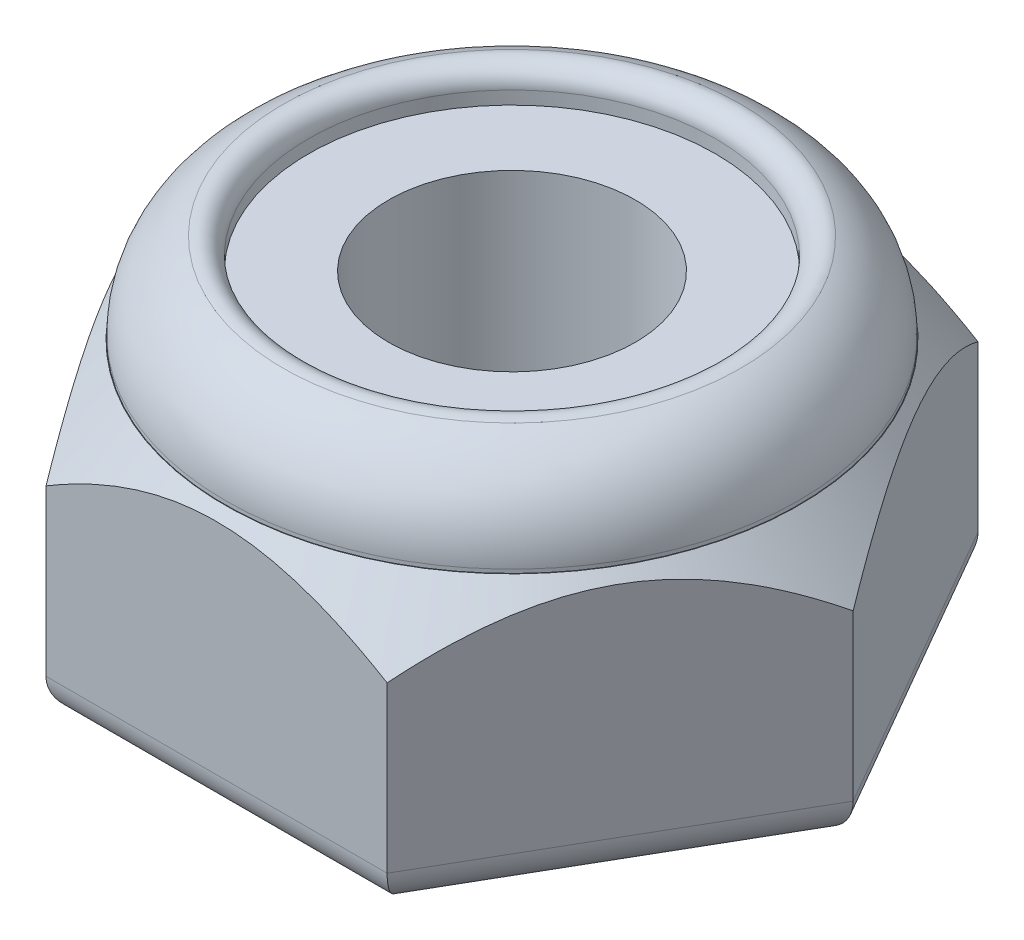
ISO-10303-21;
HEADER;
FILE_DESCRIPTION(('STEP AP214'),'2;1');
FILE_NAME('part.step','',(''),(''),'','','');
FILE_SCHEMA(('AUTOMOTIVE_DESIGN { 1 0 10303 214 1 1 1 1 }'));
ENDSEC;
DATA;
#1=APPLICATION_CONTEXT('core data for automotive mechanical design processes');
#2=APPLICATION_PROTOCOL_DEFINITION('international standard','automotive_design',2000,#1);
#3=PRODUCT_CONTEXT('',#1,'mechanical');
#4=PRODUCT('Part','Part','',(#3));
#5=PRODUCT_RELATED_PRODUCT_CATEGORY('part','',(#4));
#6=PRODUCT_DEFINITION_FORMATION('','',#4);
#7=PRODUCT_DEFINITION_CONTEXT('part definition',#1,'design');
#8=PRODUCT_DEFINITION('design','',#6,#7);
#9=PRODUCT_DEFINITION_SHAPE('','',#8);
#10=(LENGTH_UNIT() NAMED_UNIT(*) SI_UNIT(.MILLI.,.METRE.));
#11=(NAMED_UNIT(*) PLANE_ANGLE_UNIT() SI_UNIT($,.RADIAN.));
#12=(NAMED_UNIT(*) SI_UNIT($,.STERADIAN.) SOLID_ANGLE_UNIT());
#13=UNCERTAINTY_MEASURE_WITH_UNIT(LENGTH_MEASURE(1.E-05),#10,'distance_accuracy_value','');
#14=(GEOMETRIC_REPRESENTATION_CONTEXT(3) GLOBAL_UNCERTAINTY_ASSIGNED_CONTEXT((#13)) GLOBAL_UNIT_ASSIGNED_CONTEXT((#10,
#11,#12)) REPRESENTATION_CONTEXT('',''));
#15=CARTESIAN_POINT('',(0.,0.,0.));
#16=DIRECTION('',(0.,0.,1.));
#17=DIRECTION('',(1.,0.,0.));
#18=AXIS2_PLACEMENT_3D('',#15,#16,#17);
#19=CARTESIAN_POINT('',(0.,4.9784,0.));
#20=DIRECTION('',(0.,-1.,0.));
#21=DIRECTION('',(0.,0.,-1.));
#22=AXIS2_PLACEMENT_3D('',#19,#20,#21);
#23=CYLINDRICAL_SURFACE('',#22,3.937);
#24=CARTESIAN_POINT('',(0.,3.7084,0.));
#25=DIRECTION('',(0.,1.,0.));
#26=DIRECTION('',(0.,0.,1.));
#27=AXIS2_PLACEMENT_3D('',#24,#25,#26);
#28=CIRCLE('',#27,3.937);
#29=CARTESIAN_POINT('',(0.,3.7084,3.937));
#30=VERTEX_POINT('',#29);
#31=EDGE_CURVE('E243',#30,#30,#28,.T.);
#32=ORIENTED_EDGE('',*,*,#31,.F.);
#33=EDGE_LOOP('',(#32));
#34=FACE_BOUND('',#33,.T.);
#35=CARTESIAN_POINT('',(0.,3.6576,0.));
#36=DIRECTION('',(0.,-1.,0.));
#37=DIRECTION('',(0.,0.,-1.));
#38=AXIS2_PLACEMENT_3D('',#35,#36,#37);
#39=CIRCLE('',#38,3.937);
#40=CARTESIAN_POINT('',(0.,3.6576,-3.937));
#41=VERTEX_POINT('',#40);
#42=EDGE_CURVE('E19',#41,#41,#39,.F.);
#43=ORIENTED_EDGE('',*,*,#42,.T.);
#44=EDGE_LOOP('',(#43));
#45=FACE_BOUND('',#44,.T.);
#46=ADVANCED_FACE('F16',(#34,#45),#23,.T.);
#47=CARTESIAN_POINT('',(0.,3.7084,0.));
#48=DIRECTION('',(0.,1.,0.));
#49=DIRECTION('',(0.,0.,1.));
#50=AXIS2_PLACEMENT_3D('',#47,#48,#49);
#51=TOROIDAL_SURFACE('',#50,2.667,1.27);
#52=ORIENTED_EDGE('',*,*,#31,.T.);
#53=EDGE_LOOP('',(#52));
#54=FACE_BOUND('',#53,.T.);
#55=CARTESIAN_POINT('',(0.,4.88572150982644,0.));
#56=DIRECTION('',(0.,-1.,0.));
#57=DIRECTION('',(0.,0.,-1.));
#58=AXIS2_PLACEMENT_3D('',#55,#56,#57);
#59=CIRCLE('',#58,3.14325);
#60=CARTESIAN_POINT('',(0.,4.88572150982644,-3.14325));
#61=VERTEX_POINT('',#60);
#62=EDGE_CURVE('E237',#61,#61,#59,.F.);
#63=ORIENTED_EDGE('',*,*,#62,.F.);
#64=EDGE_LOOP('',(#63));
#65=FACE_BOUND('',#64,.T.);
#66=ADVANCED_FACE('F134',(#54,#65),#51,.T.);
#67=CARTESIAN_POINT('',(2.34315,3.6576,4.05845484975502));
#68=DIRECTION('',(0.,-1.,0.));
#69=DIRECTION('',(0.,0.,-1.));
#70=AXIS2_PLACEMENT_3D('',#67,#68,#69);
#71=PLANE('',#70);
#72=ORIENTED_EDGE('',*,*,#42,.F.);
#73=EDGE_LOOP('',(#72));
#74=FACE_BOUND('',#73,.T.);
#75=CARTESIAN_POINT('',(0.,3.65760000011051,0.));
#76=DIRECTION('',(0.,-1.,0.));
#77=DIRECTION('',(0.,0.,-1.));
#78=AXIS2_PLACEMENT_3D('',#75,#76,#77);
#79=CIRCLE('',#78,3.94407100938664);
#80=CARTESIAN_POINT('',(0.,3.65760000011051,-3.94407100938664));
#81=VERTEX_POINT('',#80);
#82=EDGE_CURVE('E119',#81,#81,#79,.T.);
#83=ORIENTED_EDGE('',*,*,#82,.F.);
#84=EDGE_LOOP('',(#83));
#85=FACE_BOUND('',#84,.T.);
#86=ADVANCED_FACE('F129',(#74,#85),#71,.F.);
#87=CARTESIAN_POINT('',(0.,4.65025720786115,0.));
#88=DIRECTION('',(0.,-1.,0.));
#89=DIRECTION('',(0.,0.,-1.));
#90=AXIS2_PLACEMENT_3D('',#87,#88,#89);
#91=TOROIDAL_SURFACE('',#90,3.048,0.254);
#92=CARTESIAN_POINT('',(0.,4.65025720786115,0.));
#93=DIRECTION('',(0.,1.,0.));
#94=DIRECTION('',(0.,0.,1.));
#95=AXIS2_PLACEMENT_3D('',#92,#93,#94);
#96=CIRCLE('',#95,2.794);
#97=CARTESIAN_POINT('',(0.,4.65025720786115,2.794));
#98=VERTEX_POINT('',#97);
#99=EDGE_CURVE('E104',#98,#98,#96,.F.);
#100=ORIENTED_EDGE('',*,*,#99,.T.);
#101=EDGE_LOOP('',(#100));
#102=FACE_BOUND('',#101,.T.);
#103=ORIENTED_EDGE('',*,*,#62,.T.);
#104=EDGE_LOOP('',(#103));
#105=FACE_BOUND('',#104,.T.);
#106=ADVANCED_FACE('F125',(#102,#105),#91,.T.);
#107=CARTESIAN_POINT('',(0.,2.76773860969115,0.));
#108=DIRECTION('',(0.,-1.,0.));
#109=DIRECTION('',(0.,0.,-1.));
#110=AXIS2_PLACEMENT_3D('',#107,#108,#109);
#111=CONICAL_SURFACE('',#110,4.69075337389313,0.698131700802158);
#112=CARTESIAN_POINT('',(-4.68630000001476,2.77304593398821,-5.33338044389321E-11));
#113=CARTESIAN_POINT('',(-4.65177717141793,2.81418235889091,0.0597952931149053));
#114=CARTESIAN_POINT('',(-4.61695780288956,2.85432113110728,0.120104208500933));
#115=CARTESIAN_POINT('',(-4.54666264441453,2.93230661020916,0.241858994511412));
#116=CARTESIAN_POINT('',(-4.51118655194523,2.97015222462005,0.303305389120424));
#117=CARTESIAN_POINT('',(-4.40329561885259,3.08018701500149,0.490177966909937));
#118=CARTESIAN_POINT('',(-4.32983334004397,3.14837015576205,0.617418366247689));
#119=CARTESIAN_POINT('',(-4.1797796499728,3.27092778609509,0.877318981315214));
#120=CARTESIAN_POINT('',(-4.10317943932402,3.32525984886677,1.00999443802899));
#121=CARTESIAN_POINT('',(-3.94747591651277,3.41577217646148,1.27968085045525));
#122=CARTESIAN_POINT('',(-3.86837998243724,3.45200143013375,1.4166790269463));
#123=CARTESIAN_POINT('',(-3.73746585196202,3.49372811243502,1.64342895235813));
#124=CARTESIAN_POINT('',(-3.68614686019516,3.50560413715319,1.73231605349153));
#125=CARTESIAN_POINT('',(-3.58316406708587,3.52008140702852,1.91068748346216));
#126=CARTESIAN_POINT('',(-3.53150020834088,3.5226810675312,2.00017191172355));
#127=CARTESIAN_POINT('',(-3.42855034551142,3.51847006524789,2.17848630477643));
#128=CARTESIAN_POINT('',(-3.3772638088531,3.51171021118306,2.26731719201287));
#129=CARTESIAN_POINT('',(-3.27519197708947,3.48921023555424,2.4441107906491));
#130=CARTESIAN_POINT('',(-3.22440670715057,3.4734696654174,2.53207345845939));
#131=CARTESIAN_POINT('',(-3.10963060134479,3.42817062222156,2.73087150520989));
#132=CARTESIAN_POINT('',(-3.04589899577138,3.39598542076133,2.84125788411099));
#133=CARTESIAN_POINT('',(-2.92018166739655,3.32004827846255,3.05900668424801));
#134=CARTESIAN_POINT('',(-2.85819691962206,3.27629001415058,3.16636741668776));
#135=CARTESIAN_POINT('',(-2.735889068299,3.17910361386979,3.37821082934389));
#136=CARTESIAN_POINT('',(-2.67557364738244,3.12563730731956,3.48268020285126));
#137=CARTESIAN_POINT('',(-2.55683004320588,3.01104764609313,3.68835015835892));
#138=CARTESIAN_POINT('',(-2.49840123089761,2.94992687749399,3.78955182990274));
#139=CARTESIAN_POINT('',(-2.42439626092569,2.86741854625153,3.91773219790672));
#140=CARTESIAN_POINT('',(-2.40802320106583,2.84883596648691,3.94609116945937));
#141=CARTESIAN_POINT('',(-2.3754621576302,2.81125673907332,4.00248855103733));
#142=CARTESIAN_POINT('',(-2.35927376441604,2.79226151161516,4.03052767057717));
#143=CARTESIAN_POINT('',(-2.3431499999717,2.77304593399368,4.05845484980404));
#144=B_SPLINE_CURVE_WITH_KNOTS('',3,(#112,#113,#114,#115,#116,#117,#118,#119,#120,#121,#122,
#123,#124,#125,#126,#127,#128,#129,#130,#131,#132,#133,#134,#135,#136,#137,#138,#139,#140,#141,
#142,#143),.UNSPECIFIED.,.F.,.F.,(4,2,2,2,2,2,2,2,2,2,2,2,2,2,2,4),(0.,0.241096809088565,
0.48230758945251,0.967637153847366,1.45443592242802,1.93991010956963,2.24950193433618,
2.55914664324831,2.86711700071403,3.17510274216898,3.56882084711336,3.96275452403261,
4.35827201930639,4.75365624679115,4.86660838982692,4.97921936905084),.UNSPECIFIED.);
#145=CARTESIAN_POINT('',(-4.68630000002839,2.77304593399358,0.));
#146=VERTEX_POINT('',#145);
#147=CARTESIAN_POINT('',(-2.34315000001419,2.77304593399358,4.05845484977959));
#148=VERTEX_POINT('',#147);
#149=EDGE_CURVE('E91',#146,#148,#144,.T.);
#150=ORIENTED_EDGE('',*,*,#149,.T.);
#151=CARTESIAN_POINT('',(-2.34315000005357,2.77304593398822,4.05845484974113));
#152=CARTESIAN_POINT('',(-2.27415972170409,2.81414935271336,4.05845484974989));
#153=CARTESIAN_POINT('',(-2.20457738522044,2.85425669884705,4.05845484975361));
#154=CARTESIAN_POINT('',(-2.06410193528095,2.93218331968194,4.05845484975642));
#155=CARTESIAN_POINT('',(-1.99320821641151,2.9700015013142,4.05845484975551));
#156=CARTESIAN_POINT('',(-1.77754688772429,3.07999086386455,4.05845484975401));
#157=CARTESIAN_POINT('',(-1.63068545869954,3.1481589403704,4.05845484975469));
#158=CARTESIAN_POINT('',(-1.33052752457963,3.27077676919262,4.05845484975534));
#159=CARTESIAN_POINT('',(-1.17720631609342,3.32516696804196,4.0584548497553));
#160=CARTESIAN_POINT('',(-0.86561350380778,3.41574608766059,4.05845484975473));
#161=CARTESIAN_POINT('',(-0.707359229311903,3.45199244874899,4.0584548497542));
#162=CARTESIAN_POINT('',(-0.456822143345071,3.49192146546895,4.05845484975548));
#163=CARTESIAN_POINT('',(-0.365672921156202,3.50290887295604,4.05845484975637));
#164=CARTESIAN_POINT('',(-0.183016322004482,3.51758027913678,4.05845484975366));
#165=CARTESIAN_POINT('',(-0.0915105175250816,3.52128341037061,4.05845484975007));
#166=CARTESIAN_POINT('',(0.104649468641441,3.52128177491765,4.0584548497495));
#167=CARTESIAN_POINT('',(0.209305100872023,3.51643705333648,4.05845484975354));
#168=CARTESIAN_POINT('',(0.41778718190987,3.49730239560235,4.05845484975649));
#169=CARTESIAN_POINT('',(0.521613181352877,3.48300765111694,4.05845484975541));
#170=CARTESIAN_POINT('',(0.728332544913561,3.44553375886282,4.05845484975462));
#171=CARTESIAN_POINT('',(0.831215331558566,3.42229697724238,4.05845484975491));
#172=CARTESIAN_POINT('',(1.03487580391125,3.36791830054733,4.05845484975512));
#173=CARTESIAN_POINT('',(1.13565289468809,3.33677420321768,4.05845484975504));
#174=CARTESIAN_POINT('',(1.33273383822163,3.26838741918099,4.05845484975499));
#175=CARTESIAN_POINT('',(1.42908716226035,3.23128582684656,4.05845484975501));
#176=CARTESIAN_POINT('',(1.61947291708309,3.15151071591982,4.05845484975502));
#177=CARTESIAN_POINT('',(1.71350470709807,3.10883567899407,4.05845484975502));
#178=CARTESIAN_POINT('',(1.89803195382395,3.01941532331662,4.05845484975501));
#179=CARTESIAN_POINT('',(1.98855798046432,2.97273255726059,4.05845484975502));
#180=CARTESIAN_POINT('',(2.16742834958163,2.87556944084479,4.05845484975502));
#181=CARTESIAN_POINT('',(2.25577492892455,2.82509321932285,4.05845484975502));
#182=CARTESIAN_POINT('',(2.34315000005566,2.77304593399424,4.05845484975502));
#183=B_SPLINE_CURVE_WITH_KNOTS('',3,(#151,#152,#153,#154,#155,#156,#157,#158,#159,#160,#161,
#162,#163,#164,#165,#166,#167,#168,#169,#170,#171,#172,#173,#174,#175,#176,#177,#178,#179,#180,
#181,#182),.UNSPECIFIED.,.F.,.F.,(4,2,2,2,2,2,2,2,2,2,2,2,2,2,2,4),(0.,0.24090330355952,
0.481920744736242,0.967059466968447,1.4542606837498,1.93990959177134,2.21507934695766,
2.4895253838939,2.80337599596431,3.11738642360393,3.43345557972405,3.74961286055439,
4.0591611810716,4.36879400620232,4.67425708545866,4.97939238068026),.UNSPECIFIED.);
#184=CARTESIAN_POINT('',(2.34315000001419,2.77304593399358,4.05845484977959));
#185=VERTEX_POINT('',#184);
#186=EDGE_CURVE('E83',#148,#185,#183,.T.);
#187=ORIENTED_EDGE('',*,*,#186,.T.);
#188=CARTESIAN_POINT('',(2.3431499999612,2.77304593398822,4.05845484979446));
#189=CARTESIAN_POINT('',(2.37767282857321,2.81418235889091,3.99865955663499));
#190=CARTESIAN_POINT('',(2.41249219710801,2.85432113110729,3.93835064125267));
#191=CARTESIAN_POINT('',(2.48278735558791,2.93230661020917,3.816595855245));
#192=CARTESIAN_POINT('',(2.51826344805563,2.97015222462005,3.75514946063508));
#193=CARTESIAN_POINT('',(2.62615438114571,3.0801870150015,3.56827688284408));
#194=CARTESIAN_POINT('',(2.69961665995557,3.14837015576206,3.44103648350706));
#195=CARTESIAN_POINT('',(2.84967035002766,3.2709277860951,3.18113586844006));
#196=CARTESIAN_POINT('',(2.9262705606761,3.32525984886677,3.04846041172609));
#197=CARTESIAN_POINT('',(3.08197408348711,3.41577217646148,2.77877399929969));
#198=CARTESIAN_POINT('',(3.16107001756274,3.45200143013376,2.64177582280869));
#199=CARTESIAN_POINT('',(3.291984148038,3.49372811243503,2.41502589739689));
#200=CARTESIAN_POINT('',(3.34330313980485,3.50560413715319,2.32613879626348));
#201=CARTESIAN_POINT('',(3.44628593291413,3.52008140702853,2.14776736629285));
#202=CARTESIAN_POINT('',(3.49794979165912,3.52268106753121,2.05828293803146));
#203=CARTESIAN_POINT('',(3.60089965448859,3.51847006524789,1.87996854497858));
#204=CARTESIAN_POINT('',(3.6521861911469,3.51171021118306,1.79113765774214));
#205=CARTESIAN_POINT('',(3.75425802291053,3.48921023555425,1.61434405910591));
#206=CARTESIAN_POINT('',(3.80504329284943,3.47346966541741,1.52638139129562));
#207=CARTESIAN_POINT('',(3.91981939865521,3.42817062222156,1.32758334454512));
#208=CARTESIAN_POINT('',(3.98355100422862,3.39598542076133,1.21719696564402));
#209=CARTESIAN_POINT('',(4.10926833260345,3.32004827846255,0.999448165506998));
#210=CARTESIAN_POINT('',(4.17125308037794,3.27629001415058,0.892087433067249));
#211=CARTESIAN_POINT('',(4.293560931701,3.17910361386979,0.680244020411123));
#212=CARTESIAN_POINT('',(4.35387635261756,3.12563730731956,0.575774646903748));
#213=CARTESIAN_POINT('',(4.47261995679412,3.01104764609313,0.370104691396085));
#214=CARTESIAN_POINT('',(4.53104876910239,2.94992687749399,0.268903019852267));
#215=CARTESIAN_POINT('',(4.60505373907431,2.86741854625153,0.140722651848287));
#216=CARTESIAN_POINT('',(4.62142679893417,2.84883596648691,0.112363680295637));
#217=CARTESIAN_POINT('',(4.6539878423698,2.81125673907332,0.0559662987176779));
#218=CARTESIAN_POINT('',(4.67017623558396,2.79226151161516,0.0279271791778418));
#219=CARTESIAN_POINT('',(4.6863000000283,2.77304593399368,-4.90270010654762E-11));
#220=B_SPLINE_CURVE_WITH_KNOTS('',3,(#188,#189,#190,#191,#192,#193,#194,#195,#196,#197,#198,
#199,#200,#201,#202,#203,#204,#205,#206,#207,#208,#209,#210,#211,#212,#213,#214,#215,#216,#217,
#218,#219),.UNSPECIFIED.,.F.,.F.,(4,2,2,2,2,2,2,2,2,2,2,2,2,2,2,4),(0.,0.241096809088565,
0.48230758945251,0.967637153847364,1.45443592242802,1.93991010956962,2.24950193433617,
2.5591466432483,2.86711700071402,3.17510274216897,3.56882084711336,3.9627545240326,
4.35827201930639,4.75365624679114,4.86660838982692,4.97921936905084),.UNSPECIFIED.);
#221=CARTESIAN_POINT('',(4.68630000001419,2.7730459340105,-2.45819040202403E-11));
#222=VERTEX_POINT('',#221);
#223=EDGE_CURVE('E88',#185,#222,#220,.T.);
#224=ORIENTED_EDGE('',*,*,#223,.T.);
#225=CARTESIAN_POINT('',(4.68630000001476,2.77304593398822,5.33267015141622E-11));
#226=CARTESIAN_POINT('',(4.65177717141792,2.81418235889091,-0.0597952931149122));
#227=CARTESIAN_POINT('',(4.61695780288956,2.85432113110729,-0.12010420850094));
#228=CARTESIAN_POINT('',(4.54666264441452,2.93230661020917,-0.241858994511418));
#229=CARTESIAN_POINT('',(4.51118655194522,2.97015222462005,-0.303305389120429));
#230=CARTESIAN_POINT('',(4.40329561885258,3.0801870150015,-0.490177966909942));
#231=CARTESIAN_POINT('',(4.32983334004397,3.14837015576206,-0.617418366247693));
#232=CARTESIAN_POINT('',(4.1797796499728,3.27092778609509,-0.877318981315217));
#233=CARTESIAN_POINT('',(4.10317943932402,3.32525984886677,-1.00999443802899));
#234=CARTESIAN_POINT('',(3.94747591651277,3.41577217646148,-1.27968085045525));
#235=CARTESIAN_POINT('',(3.86837998243724,3.45200143013375,-1.4166790269463));
#236=CARTESIAN_POINT('',(3.73746585196202,3.49372811243502,-1.64342895235813));
#237=CARTESIAN_POINT('',(3.68614686019516,3.50560413715319,-1.73231605349153));
#238=CARTESIAN_POINT('',(3.58316406708587,3.52008140702852,-1.91068748346216));
#239=CARTESIAN_POINT('',(3.53150020834088,3.5226810675312,-2.00017191172355));
#240=CARTESIAN_POINT('',(3.42855034551142,3.51847006524789,-2.17848630477643));
#241=CARTESIAN_POINT('',(3.3772638088531,3.51171021118306,-2.26731719201287));
#242=CARTESIAN_POINT('',(3.27519197708947,3.48921023555424,-2.4441107906491));
#243=CARTESIAN_POINT('',(3.22440670715057,3.4734696654174,-2.53207345845939));
#244=CARTESIAN_POINT('',(3.10963060134479,3.42817062222156,-2.73087150520989));
#245=CARTESIAN_POINT('',(3.04589899577138,3.39598542076133,-2.84125788411098));
#246=CARTESIAN_POINT('',(2.92018166739655,3.32004827846255,-3.05900668424801));
#247=CARTESIAN_POINT('',(2.85819691962206,3.27629001415058,-3.16636741668776));
#248=CARTESIAN_POINT('',(2.735889068299,3.17910361386979,-3.37821082934388));
#249=CARTESIAN_POINT('',(2.67557364738245,3.12563730731956,-3.48268020285126));
#250=CARTESIAN_POINT('',(2.55683004320588,3.01104764609313,-3.68835015835892));
#251=CARTESIAN_POINT('',(2.49840123089761,2.94992687749399,-3.78955182990274));
#252=CARTESIAN_POINT('',(2.42439626092569,2.86741854625153,-3.91773219790672));
#253=CARTESIAN_POINT('',(2.40802320106583,2.84883596648691,-3.94609116945937));
#254=CARTESIAN_POINT('',(2.3754621576302,2.81125673907332,-4.00248855103733));
#255=CARTESIAN_POINT('',(2.35927376441604,2.79226151161516,-4.03052767057717));
#256=CARTESIAN_POINT('',(2.3431499999717,2.77304593399368,-4.05845484980404));
#257=B_SPLINE_CURVE_WITH_KNOTS('',3,(#225,#226,#227,#228,#229,#230,#231,#232,#233,#234,#235,
#236,#237,#238,#239,#240,#241,#242,#243,#244,#245,#246,#247,#248,#249,#250,#251,#252,#253,#254,
#255,#256),.UNSPECIFIED.,.F.,.F.,(4,2,2,2,2,2,2,2,2,2,2,2,2,2,2,4),(0.,0.241096809088563,
0.482307589452507,0.967637153847359,1.45443592242801,1.93991010956962,2.24950193433616,
2.55914664324829,2.86711700071401,3.17510274216897,3.56882084711335,3.96275452403259,
4.35827201930638,4.75365624679114,4.86660838982692,4.97921936905084),.UNSPECIFIED.);
#258=CARTESIAN_POINT('',(2.34315000001419,2.77304593399358,-4.0584548497796));
#259=VERTEX_POINT('',#258);
#260=EDGE_CURVE('E193',#222,#259,#257,.T.);
#261=ORIENTED_EDGE('',*,*,#260,.T.);
#262=CARTESIAN_POINT('',(2.34315000005357,2.77304593398821,-4.05845484974114));
#263=CARTESIAN_POINT('',(2.27415972170409,2.81414935271335,-4.05845484974989));
#264=CARTESIAN_POINT('',(2.20457738522045,2.85425669884704,-4.05845484975361));
#265=CARTESIAN_POINT('',(2.06410193528096,2.93218331968193,-4.05845484975643));
#266=CARTESIAN_POINT('',(1.99320821641151,2.97000150131419,-4.05845484975552));
#267=CARTESIAN_POINT('',(1.77754688772429,3.07999086386454,-4.05845484975402));
#268=CARTESIAN_POINT('',(1.63068545869954,3.1481589403704,-4.0584548497547));
#269=CARTESIAN_POINT('',(1.33052752457963,3.27077676919261,-4.05845484975534));
#270=CARTESIAN_POINT('',(1.17720631609342,3.32516696804195,-4.0584548497553));
#271=CARTESIAN_POINT('',(0.865613503807778,3.41574608766058,-4.05845484975474));
#272=CARTESIAN_POINT('',(0.707359229311901,3.45199244874898,-4.0584548497542));
#273=CARTESIAN_POINT('',(0.456822143345069,3.49192146546895,-4.05845484975548));
#274=CARTESIAN_POINT('',(0.365672921156201,3.50290887295604,-4.05845484975637));
#275=CARTESIAN_POINT('',(0.183016322004481,3.51758027913677,-4.05845484975367));
#276=CARTESIAN_POINT('',(0.0915105175250814,3.5212834103706,-4.05845484975008));
#277=CARTESIAN_POINT('',(-0.104649468641441,3.52128177491764,-4.0584548497495));
#278=CARTESIAN_POINT('',(-0.209305100872023,3.51643705333648,-4.05845484975354));
#279=CARTESIAN_POINT('',(-0.41778718190987,3.49730239560234,-4.0584548497565));
#280=CARTESIAN_POINT('',(-0.521613181352877,3.48300765111693,-4.05845484975542));
#281=CARTESIAN_POINT('',(-0.728332544913562,3.44553375886281,-4.05845484975462));
#282=CARTESIAN_POINT('',(-0.831215331558566,3.42229697724237,-4.05845484975491));
#283=CARTESIAN_POINT('',(-1.03487580391125,3.36791830054732,-4.05845484975513));
#284=CARTESIAN_POINT('',(-1.13565289468809,3.33677420321767,-4.05845484975505));
#285=CARTESIAN_POINT('',(-1.33273383822163,3.26838741918098,-4.05845484975499));
#286=CARTESIAN_POINT('',(-1.42908716226035,3.23128582684655,-4.05845484975501));
#287=CARTESIAN_POINT('',(-1.61947291708309,3.15151071591982,-4.05845484975503));
#288=CARTESIAN_POINT('',(-1.71350470709807,3.10883567899406,-4.05845484975502));
#289=CARTESIAN_POINT('',(-1.89803195382395,3.01941532331662,-4.05845484975502));
#290=CARTESIAN_POINT('',(-1.98855798046431,2.97273255726059,-4.05845484975502));
#291=CARTESIAN_POINT('',(-2.16742834958162,2.87556944084479,-4.05845484975502));
#292=CARTESIAN_POINT('',(-2.25577492892455,2.82509321932284,-4.05845484975502));
#293=CARTESIAN_POINT('',(-2.34315000005566,2.77304593399424,-4.05845484975502));
#294=B_SPLINE_CURVE_WITH_KNOTS('',3,(#262,#263,#264,#265,#266,#267,#268,#269,#270,#271,#272,
#273,#274,#275,#276,#277,#278,#279,#280,#281,#282,#283,#284,#285,#286,#287,#288,#289,#290,#291,
#292,#293),.UNSPECIFIED.,.F.,.F.,(4,2,2,2,2,2,2,2,2,2,2,2,2,2,2,4),(0.,0.24090330355952,
0.481920744736243,0.96705946696845,1.4542606837498,1.93990959177135,2.21507934695766,
2.48952538389391,2.80337599596432,3.11738642360394,3.43345557972405,3.74961286055439,
4.0591611810716,4.36879400620232,4.67425708545866,4.97939238068026),.UNSPECIFIED.);
#295=CARTESIAN_POINT('',(-2.34315000001419,2.77304593399358,-4.0584548497796));
#296=VERTEX_POINT('',#295);
#297=EDGE_CURVE('E203',#259,#296,#294,.T.);
#298=ORIENTED_EDGE('',*,*,#297,.T.);
#299=CARTESIAN_POINT('',(-2.3431499999612,2.77304593398821,-4.05845484979447));
#300=CARTESIAN_POINT('',(-2.37767282857321,2.81418235889091,-3.99865955663499));
#301=CARTESIAN_POINT('',(-2.41249219710802,2.85432113110728,-3.93835064125268));
#302=CARTESIAN_POINT('',(-2.48278735558791,2.93230661020916,-3.81659585524501));
#303=CARTESIAN_POINT('',(-2.51826344805563,2.97015222462005,-3.75514946063508));
#304=CARTESIAN_POINT('',(-2.62615438114571,3.08018701500149,-3.56827688284409));
#305=CARTESIAN_POINT('',(-2.69961665995557,3.14837015576205,-3.44103648350706));
#306=CARTESIAN_POINT('',(-2.84967035002766,3.27092778609509,-3.18113586844007));
#307=CARTESIAN_POINT('',(-2.9262705606761,3.32525984886676,-3.0484604117261));
#308=CARTESIAN_POINT('',(-3.08197408348711,3.41577217646147,-2.7787739992997));
#309=CARTESIAN_POINT('',(-3.16107001756274,3.45200143013375,-2.6417758228087));
#310=CARTESIAN_POINT('',(-3.291984148038,3.49372811243502,-2.4150258973969));
#311=CARTESIAN_POINT('',(-3.34330313980485,3.50560413715318,-2.32613879626349));
#312=CARTESIAN_POINT('',(-3.44628593291413,3.52008140702852,-2.14776736629286));
#313=CARTESIAN_POINT('',(-3.49794979165912,3.5226810675312,-2.05828293803147));
#314=CARTESIAN_POINT('',(-3.60089965448859,3.51847006524788,-1.87996854497859));
#315=CARTESIAN_POINT('',(-3.6521861911469,3.51171021118305,-1.79113765774215));
#316=CARTESIAN_POINT('',(-3.75425802291053,3.48921023555424,-1.61434405910592));
#317=CARTESIAN_POINT('',(-3.80504329284944,3.4734696654174,-1.52638139129563));
#318=CARTESIAN_POINT('',(-3.91981939865521,3.42817062222155,-1.32758334454513));
#319=CARTESIAN_POINT('',(-3.98355100422863,3.39598542076132,-1.21719696564403));
#320=CARTESIAN_POINT('',(-4.10926833260346,3.32004827846254,-0.999448165507007));
#321=CARTESIAN_POINT('',(-4.17125308037794,3.27629001415057,-0.892087433067259));
#322=CARTESIAN_POINT('',(-4.29356093170101,3.17910361386978,-0.680244020411133));
#323=CARTESIAN_POINT('',(-4.35387635261756,3.12563730731955,-0.575774646903757));
#324=CARTESIAN_POINT('',(-4.47261995679413,3.01104764609312,-0.370104691396094));
#325=CARTESIAN_POINT('',(-4.53104876910239,2.94992687749399,-0.268903019852276));
#326=CARTESIAN_POINT('',(-4.60505373907432,2.86741854625152,-0.140722651848295));
#327=CARTESIAN_POINT('',(-4.62142679893418,2.84883596648691,-0.112363680295645));
#328=CARTESIAN_POINT('',(-4.6539878423698,2.81125673907331,-0.0559662987176854));
#329=CARTESIAN_POINT('',(-4.67017623558397,2.79226151161515,-0.0279271791778493));
#330=CARTESIAN_POINT('',(-4.68630000002831,2.77304593399367,4.90195592876359E-11));
#331=B_SPLINE_CURVE_WITH_KNOTS('',3,(#299,#300,#301,#302,#303,#304,#305,#306,#307,#308,#309,
#310,#311,#312,#313,#314,#315,#316,#317,#318,#319,#320,#321,#322,#323,#324,#325,#326,#327,#328,
#329,#330),.UNSPECIFIED.,.F.,.F.,(4,2,2,2,2,2,2,2,2,2,2,2,2,2,2,4),(0.,0.241096809088565,
0.482307589452509,0.967637153847361,1.45443592242802,1.93991010956962,2.24950193433617,
2.5591466432483,2.86711700071402,3.17510274216897,3.56882084711335,3.9627545240326,
4.35827201930639,4.75365624679114,4.86660838982692,4.97921936905084),.UNSPECIFIED.);
#332=EDGE_CURVE('E209',#296,#146,#331,.T.);
#333=ORIENTED_EDGE('',*,*,#332,.T.);
#334=EDGE_LOOP('',(#150,#187,#224,#261,#298,#333));
#335=FACE_BOUND('',#334,.T.);
#336=ORIENTED_EDGE('',*,*,#82,.T.);
#337=EDGE_LOOP('',(#336));
#338=FACE_BOUND('',#337,.T.);
#339=ADVANCED_FACE('F85',(#335,#338),#111,.T.);
#340=CARTESIAN_POINT('',(0.,4.4704,0.));
#341=DIRECTION('',(0.,1.,0.));
#342=DIRECTION('',(0.,0.,1.));
#343=AXIS2_PLACEMENT_3D('',#340,#341,#342);
#344=CYLINDRICAL_SURFACE('',#343,2.794);
#345=ORIENTED_EDGE('',*,*,#99,.F.);
#346=EDGE_LOOP('',(#345));
#347=FACE_BOUND('',#346,.T.);
#348=CARTESIAN_POINT('',(0.,4.4704,0.));
#349=DIRECTION('',(0.,1.,0.));
#350=DIRECTION('',(0.,0.,1.));
#351=AXIS2_PLACEMENT_3D('',#348,#349,#350);
#352=CIRCLE('',#351,2.794);
#353=CARTESIAN_POINT('',(0.,4.4704,2.794));
#354=VERTEX_POINT('',#353);
#355=EDGE_CURVE('E201',#354,#354,#352,.T.);
#356=ORIENTED_EDGE('',*,*,#355,.F.);
#357=EDGE_LOOP('',(#356));
#358=FACE_BOUND('',#357,.T.);
#359=ADVANCED_FACE('F405',(#347,#358),#344,.F.);
#360=CARTESIAN_POINT('',(2.34315,3.6576,4.05845484975502));
#361=DIRECTION('',(-0.866025403784439,0.,-0.499999999999999));
#362=DIRECTION('',(-0.499999999999999,0.,0.866025403784439));
#363=AXIS2_PLACEMENT_3D('',#360,#361,#362);
#364=PLANE('',#363);
#365=DIRECTION('',(-0.499999999999999,0.,0.866025403784439));
#366=VECTOR('',#365,1.);
#367=CARTESIAN_POINT('',(2.34315,0.508,4.05845484975502));
#368=LINE('',#367,#366);
#369=CARTESIAN_POINT('',(4.6863,0.508,0.));
#370=VERTEX_POINT('',#369);
#371=CARTESIAN_POINT('',(2.34315000000001,0.508,4.05845484975502));
#372=VERTEX_POINT('',#371);
#373=EDGE_CURVE('E267',#370,#372,#368,.T.);
#374=ORIENTED_EDGE('',*,*,#373,.F.);
#375=DIRECTION('',(0.,1.,0.));
#376=VECTOR('',#375,1.);
#377=CARTESIAN_POINT('',(4.6863,3.6576,0.));
#378=LINE('',#377,#376);
#379=EDGE_CURVE('E102',#370,#222,#378,.T.);
#380=ORIENTED_EDGE('',*,*,#379,.T.);
#381=ORIENTED_EDGE('',*,*,#223,.F.);
#382=DIRECTION('',(0.,1.,0.));
#383=VECTOR('',#382,1.);
#384=CARTESIAN_POINT('',(2.34315000000001,3.6576,4.05845484975502));
#385=LINE('',#384,#383);
#386=EDGE_CURVE('E95',#185,#372,#385,.F.);
#387=ORIENTED_EDGE('',*,*,#386,.T.);
#388=EDGE_LOOP('',(#374,#380,#381,#387));
#389=FACE_BOUND('',#388,.T.);
#390=ADVANCED_FACE('F99',(#389),#364,.F.);
#391=CARTESIAN_POINT('',(-2.34315,3.6576,4.05845484975501));
#392=DIRECTION('',(0.,0.,-1.));
#393=DIRECTION('',(-1.,0.,0.));
#394=AXIS2_PLACEMENT_3D('',#391,#392,#393);
#395=PLANE('',#394);
#396=DIRECTION('',(-1.,0.,0.));
#397=VECTOR('',#396,1.);
#398=CARTESIAN_POINT('',(-2.34315,0.508,4.05845484975501));
#399=LINE('',#398,#397);
#400=CARTESIAN_POINT('',(-2.34315,0.508,4.05845484975501));
#401=VERTEX_POINT('',#400);
#402=EDGE_CURVE('E109',#372,#401,#399,.T.);
#403=ORIENTED_EDGE('',*,*,#402,.F.);
#404=ORIENTED_EDGE('',*,*,#386,.F.);
#405=ORIENTED_EDGE('',*,*,#186,.F.);
#406=DIRECTION('',(0.,1.,0.));
#407=VECTOR('',#406,1.);
#408=CARTESIAN_POINT('',(-2.34315,3.6576,4.05845484975501));
#409=LINE('',#408,#407);
#410=EDGE_CURVE('E112',#148,#401,#409,.F.);
#411=ORIENTED_EDGE('',*,*,#410,.T.);
#412=EDGE_LOOP('',(#403,#404,#405,#411));
#413=FACE_BOUND('',#412,.T.);
#414=ADVANCED_FACE('F107',(#413),#395,.F.);
#415=CARTESIAN_POINT('',(-4.6863,3.6576,0.));
#416=DIRECTION('',(0.866025403784439,0.,-0.5));
#417=DIRECTION('',(-0.5,0.,-0.866025403784439));
#418=AXIS2_PLACEMENT_3D('',#415,#416,#417);
#419=PLANE('',#418);
#420=DIRECTION('',(-0.5,0.,-0.866025403784439));
#421=VECTOR('',#420,1.);
#422=CARTESIAN_POINT('',(-4.6863,0.508,0.));
#423=LINE('',#422,#421);
#424=CARTESIAN_POINT('',(-4.68630000000001,0.508,0.));
#425=VERTEX_POINT('',#424);
#426=EDGE_CURVE('E263',#401,#425,#423,.T.);
#427=ORIENTED_EDGE('',*,*,#426,.F.);
#428=ORIENTED_EDGE('',*,*,#410,.F.);
#429=ORIENTED_EDGE('',*,*,#149,.F.);
#430=DIRECTION('',(0.,1.,0.));
#431=VECTOR('',#430,1.);
#432=CARTESIAN_POINT('',(-4.68630000000001,3.6576,0.));
#433=LINE('',#432,#431);
#434=EDGE_CURVE('E208',#146,#425,#433,.F.);
#435=ORIENTED_EDGE('',*,*,#434,.T.);
#436=EDGE_LOOP('',(#427,#428,#429,#435));
#437=FACE_BOUND('',#436,.T.);
#438=ADVANCED_FACE('F220',(#437),#419,.F.);
#439=CARTESIAN_POINT('',(-2.34315,3.6576,-4.05845484975502));
#440=DIRECTION('',(0.866025403784438,0.,0.5));
#441=DIRECTION('',(0.5,0.,-0.866025403784438));
#442=AXIS2_PLACEMENT_3D('',#439,#440,#441);
#443=PLANE('',#442);
#444=DIRECTION('',(0.5,0.,-0.866025403784438));
#445=VECTOR('',#444,1.);
#446=CARTESIAN_POINT('',(-2.34315,0.508,-4.05845484975502));
#447=LINE('',#446,#445);
#448=CARTESIAN_POINT('',(-2.34315,0.508,-4.05845484975502));
#449=VERTEX_POINT('',#448);
#450=EDGE_CURVE('E259',#425,#449,#447,.T.);
#451=ORIENTED_EDGE('',*,*,#450,.F.);
#452=ORIENTED_EDGE('',*,*,#434,.F.);
#453=ORIENTED_EDGE('',*,*,#332,.F.);
#454=DIRECTION('',(0.,1.,0.));
#455=VECTOR('',#454,1.);
#456=CARTESIAN_POINT('',(-2.34315,3.6576,-4.05845484975502));
#457=LINE('',#456,#455);
#458=EDGE_CURVE('E200',#296,#449,#457,.F.);
#459=ORIENTED_EDGE('',*,*,#458,.T.);
#460=EDGE_LOOP('',(#451,#452,#453,#459));
#461=FACE_BOUND('',#460,.T.);
#462=ADVANCED_FACE('F217',(#461),#443,.F.);
#463=CARTESIAN_POINT('',(2.34315,3.6576,-4.05845484975502));
#464=DIRECTION('',(0.,0.,1.));
#465=DIRECTION('',(1.,0.,0.));
#466=AXIS2_PLACEMENT_3D('',#463,#464,#465);
#467=PLANE('',#466);
#468=DIRECTION('',(1.,0.,0.));
#469=VECTOR('',#468,1.);
#470=CARTESIAN_POINT('',(2.34315,0.508,-4.05845484975502));
#471=LINE('',#470,#469);
#472=CARTESIAN_POINT('',(2.34315,0.508,-4.05845484975502));
#473=VERTEX_POINT('',#472);
#474=EDGE_CURVE('E255',#449,#473,#471,.T.);
#475=ORIENTED_EDGE('',*,*,#474,.F.);
#476=ORIENTED_EDGE('',*,*,#458,.F.);
#477=ORIENTED_EDGE('',*,*,#297,.F.);
#478=DIRECTION('',(0.,1.,0.));
#479=VECTOR('',#478,1.);
#480=CARTESIAN_POINT('',(2.34315,3.6576,-4.05845484975501));
#481=LINE('',#480,#479);
#482=EDGE_CURVE('E199',#259,#473,#481,.F.);
#483=ORIENTED_EDGE('',*,*,#482,.T.);
#484=EDGE_LOOP('',(#475,#476,#477,#483));
#485=FACE_BOUND('',#484,.T.);
#486=ADVANCED_FACE('F188',(#485),#467,.F.);
#487=CARTESIAN_POINT('',(4.6863,3.6576,0.));
#488=DIRECTION('',(-0.866025403784439,0.,0.5));
#489=DIRECTION('',(0.5,0.,0.866025403784439));
#490=AXIS2_PLACEMENT_3D('',#487,#488,#489);
#491=PLANE('',#490);
#492=DIRECTION('',(0.5,0.,0.866025403784439));
#493=VECTOR('',#492,1.);
#494=CARTESIAN_POINT('',(4.6863,0.508,0.));
#495=LINE('',#494,#493);
#496=EDGE_CURVE('E253',#473,#370,#495,.T.);
#497=ORIENTED_EDGE('',*,*,#496,.F.);
#498=ORIENTED_EDGE('',*,*,#482,.F.);
#499=ORIENTED_EDGE('',*,*,#260,.F.);
#500=ORIENTED_EDGE('',*,*,#379,.F.);
#501=EDGE_LOOP('',(#497,#498,#499,#500));
#502=FACE_BOUND('',#501,.T.);
#503=ADVANCED_FACE('F183',(#502),#491,.F.);
#504=CARTESIAN_POINT('',(0.,4.4704,0.));
#505=DIRECTION('',(0.,1.,0.));
#506=DIRECTION('',(0.,0.,1.));
#507=AXIS2_PLACEMENT_3D('',#504,#505,#506);
#508=PLANE('',#507);
#509=CARTESIAN_POINT('',(0.,4.4704,0.));
#510=DIRECTION('',(0.,1.,0.));
#511=DIRECTION('',(0.,0.,1.));
#512=AXIS2_PLACEMENT_3D('',#509,#510,#511);
#513=CIRCLE('',#512,1.69545);
#514=CARTESIAN_POINT('',(0.,4.4704,1.69545));
#515=VERTEX_POINT('',#514);
#516=EDGE_CURVE('E246',#515,#515,#513,.F.);
#517=ORIENTED_EDGE('',*,*,#516,.T.);
#518=EDGE_LOOP('',(#517));
#519=FACE_BOUND('',#518,.T.);
#520=ORIENTED_EDGE('',*,*,#355,.T.);
#521=EDGE_LOOP('',(#520));
#522=FACE_BOUND('',#521,.T.);
#523=ADVANCED_FACE('F179',(#519,#522),#508,.T.);
#524=CARTESIAN_POINT('',(1.9032090948775,0.508,3.80445484975502));
#525=DIRECTION('',(-0.499999999999999,0.,0.866025403784439));
#526=DIRECTION('',(0.866025403784439,0.,0.499999999999999));
#527=AXIS2_PLACEMENT_3D('',#524,#525,#526);
#528=CYLINDRICAL_SURFACE('',#527,0.508);
#529=CARTESIAN_POINT('',(2.04985606325167,0.508,3.55045484975502));
#530=DIRECTION('',(-0.866025403784439,0.,0.5));
#531=DIRECTION('',(-0.5,0.,-0.866025403784439));
#532=AXIS2_PLACEMENT_3D('',#529,#530,#531);
#533=ELLIPSE('',#532,0.58658787349666,0.508);
#534=CARTESIAN_POINT('',(2.04985606325167,0.,3.55045484975502));
#535=VERTEX_POINT('',#534);
#536=EDGE_CURVE('E266',#535,#372,#533,.T.);
#537=ORIENTED_EDGE('',*,*,#536,.F.);
#538=DIRECTION('',(-0.499999999999999,0.,0.866025403784439));
#539=VECTOR('',#538,1.);
#540=CARTESIAN_POINT('',(4.09971212650334,0.,0.));
#541=LINE('',#540,#539);
#542=CARTESIAN_POINT('',(4.09971212650334,0.,0.));
#543=VERTEX_POINT('',#542);
#544=EDGE_CURVE('E249',#543,#535,#541,.T.);
#545=ORIENTED_EDGE('',*,*,#544,.F.);
#546=CARTESIAN_POINT('',(4.09971212650334,0.508,0.));
#547=DIRECTION('',(0.,0.,1.));
#548=DIRECTION('',(1.,0.,0.));
#549=AXIS2_PLACEMENT_3D('',#546,#547,#548);
#550=ELLIPSE('',#549,0.58658787349666,0.508);
#551=EDGE_CURVE('E250',#370,#543,#550,.F.);
#552=ORIENTED_EDGE('',*,*,#551,.F.);
#553=ORIENTED_EDGE('',*,*,#373,.T.);
#554=EDGE_LOOP('',(#537,#545,#552,#553));
#555=FACE_BOUND('',#554,.T.);
#556=ADVANCED_FACE('F175',(#555),#528,.T.);
#557=CARTESIAN_POINT('',(-2.34315,0.508,3.55045484975501));
#558=DIRECTION('',(-1.,0.,0.));
#559=DIRECTION('',(0.,0.,1.));
#560=AXIS2_PLACEMENT_3D('',#557,#558,#559);
#561=CYLINDRICAL_SURFACE('',#560,0.508);
#562=ORIENTED_EDGE('',*,*,#536,.T.);
#563=ORIENTED_EDGE('',*,*,#402,.T.);
#564=CARTESIAN_POINT('',(-2.04985606325167,0.508,3.55045484975501));
#565=DIRECTION('',(-0.866025403784439,0.,-0.5));
#566=DIRECTION('',(0.5,0.,-0.866025403784439));
#567=AXIS2_PLACEMENT_3D('',#564,#565,#566);
#568=ELLIPSE('',#567,0.58658787349666,0.508);
#569=CARTESIAN_POINT('',(-2.04985606325167,0.,3.55045484975502));
#570=VERTEX_POINT('',#569);
#571=EDGE_CURVE('E264',#570,#401,#568,.T.);
#572=ORIENTED_EDGE('',*,*,#571,.F.);
#573=DIRECTION('',(1.,0.,0.));
#574=VECTOR('',#573,1.);
#575=CARTESIAN_POINT('',(2.34315,0.,3.55045484975502));
#576=LINE('',#575,#574);
#577=EDGE_CURVE('E298',#535,#570,#576,.F.);
#578=ORIENTED_EDGE('',*,*,#577,.F.);
#579=EDGE_LOOP('',(#562,#563,#572,#578));
#580=FACE_BOUND('',#579,.T.);
#581=ADVANCED_FACE('F171',(#580),#561,.T.);
#582=CARTESIAN_POINT('',(-4.24635909487751,0.508,-0.254000000000004));
#583=DIRECTION('',(-0.5,0.,-0.866025403784439));
#584=DIRECTION('',(-0.866025403784439,0.,0.5));
#585=AXIS2_PLACEMENT_3D('',#582,#583,#584);
#586=CYLINDRICAL_SURFACE('',#585,0.508);
#587=ORIENTED_EDGE('',*,*,#571,.T.);
#588=ORIENTED_EDGE('',*,*,#426,.T.);
#589=CARTESIAN_POINT('',(-4.09971212650334,0.508,0.));
#590=DIRECTION('',(0.,0.,-1.));
#591=DIRECTION('',(1.,0.,0.));
#592=AXIS2_PLACEMENT_3D('',#589,#590,#591);
#593=ELLIPSE('',#592,0.58658787349666,0.508);
#594=CARTESIAN_POINT('',(-4.09971212650334,0.,0.));
#595=VERTEX_POINT('',#594);
#596=EDGE_CURVE('E260',#595,#425,#593,.T.);
#597=ORIENTED_EDGE('',*,*,#596,.F.);
#598=DIRECTION('',(-0.5,0.,-0.866025403784439));
#599=VECTOR('',#598,1.);
#600=CARTESIAN_POINT('',(-2.04985606325167,0.,3.55045484975501));
#601=LINE('',#600,#599);
#602=EDGE_CURVE('E294',#570,#595,#601,.T.);
#603=ORIENTED_EDGE('',*,*,#602,.F.);
#604=EDGE_LOOP('',(#587,#588,#597,#603));
#605=FACE_BOUND('',#604,.T.);
#606=ADVANCED_FACE('F167',(#605),#586,.T.);
#607=CARTESIAN_POINT('',(-1.90320909487751,0.508,-3.80445484975502));
#608=DIRECTION('',(0.5,0.,-0.866025403784438));
#609=DIRECTION('',(-0.866025403784438,0.,-0.5));
#610=AXIS2_PLACEMENT_3D('',#607,#608,#609);
#611=CYLINDRICAL_SURFACE('',#610,0.508);
#612=ORIENTED_EDGE('',*,*,#596,.T.);
#613=ORIENTED_EDGE('',*,*,#450,.T.);
#614=CARTESIAN_POINT('',(-2.04985606325167,0.508,-3.55045484975502));
#615=DIRECTION('',(0.866025403784439,0.,-0.5));
#616=DIRECTION('',(0.5,0.,0.866025403784439));
#617=AXIS2_PLACEMENT_3D('',#614,#615,#616);
#618=ELLIPSE('',#617,0.58658787349666,0.508);
#619=CARTESIAN_POINT('',(-2.04985606325167,0.,-3.55045484975502));
#620=VERTEX_POINT('',#619);
#621=EDGE_CURVE('E256',#620,#449,#618,.T.);
#622=ORIENTED_EDGE('',*,*,#621,.F.);
#623=DIRECTION('',(0.5,0.,-0.866025403784438));
#624=VECTOR('',#623,1.);
#625=CARTESIAN_POINT('',(-4.09971212650334,0.,0.));
#626=LINE('',#625,#624);
#627=EDGE_CURVE('E290',#595,#620,#626,.T.);
#628=ORIENTED_EDGE('',*,*,#627,.F.);
#629=EDGE_LOOP('',(#612,#613,#622,#628));
#630=FACE_BOUND('',#629,.T.);
#631=ADVANCED_FACE('F164',(#630),#611,.T.);
#632=CARTESIAN_POINT('',(2.34315,0.508,-3.55045484975502));
#633=DIRECTION('',(1.,0.,0.));
#634=DIRECTION('',(0.,0.,-1.));
#635=AXIS2_PLACEMENT_3D('',#632,#633,#634);
#636=CYLINDRICAL_SURFACE('',#635,0.508);
#637=ORIENTED_EDGE('',*,*,#621,.T.);
#638=ORIENTED_EDGE('',*,*,#474,.T.);
#639=CARTESIAN_POINT('',(2.04985606325167,0.508,-3.55045484975502));
#640=DIRECTION('',(0.866025403784439,0.,0.5));
#641=DIRECTION('',(-0.5,0.,0.866025403784439));
#642=AXIS2_PLACEMENT_3D('',#639,#640,#641);
#643=ELLIPSE('',#642,0.58658787349666,0.508);
#644=CARTESIAN_POINT('',(2.04985606325167,0.,-3.55045484975502));
#645=VERTEX_POINT('',#644);
#646=EDGE_CURVE('E34',#645,#473,#643,.T.);
#647=ORIENTED_EDGE('',*,*,#646,.F.);
#648=DIRECTION('',(1.,0.,0.));
#649=VECTOR('',#648,1.);
#650=CARTESIAN_POINT('',(2.34315,0.,-3.55045484975502));
#651=LINE('',#650,#649);
#652=EDGE_CURVE('E293',#620,#645,#651,.T.);
#653=ORIENTED_EDGE('',*,*,#652,.F.);
#654=EDGE_LOOP('',(#637,#638,#647,#653));
#655=FACE_BOUND('',#654,.T.);
#656=ADVANCED_FACE('F160',(#655),#636,.T.);
#657=CARTESIAN_POINT('',(4.2463590948775,0.508,0.253999999999996));
#658=DIRECTION('',(0.5,0.,0.866025403784439));
#659=DIRECTION('',(0.866025403784439,0.,-0.5));
#660=AXIS2_PLACEMENT_3D('',#657,#658,#659);
#661=CYLINDRICAL_SURFACE('',#660,0.508);
#662=ORIENTED_EDGE('',*,*,#551,.T.);
#663=DIRECTION('',(0.5,0.,0.866025403784439));
#664=VECTOR('',#663,1.);
#665=CARTESIAN_POINT('',(2.04985606325167,0.,-3.55045484975502));
#666=LINE('',#665,#664);
#667=EDGE_CURVE('E25',#645,#543,#666,.T.);
#668=ORIENTED_EDGE('',*,*,#667,.F.);
#669=ORIENTED_EDGE('',*,*,#646,.T.);
#670=ORIENTED_EDGE('',*,*,#496,.T.);
#671=EDGE_LOOP('',(#662,#668,#669,#670));
#672=FACE_BOUND('',#671,.T.);
#673=ADVANCED_FACE('F153',(#672),#661,.T.);
#674=CARTESIAN_POINT('',(0.,0.,0.));
#675=DIRECTION('',(0.,1.,0.));
#676=DIRECTION('',(0.,0.,1.));
#677=AXIS2_PLACEMENT_3D('',#674,#675,#676);
#678=CYLINDRICAL_SURFACE('',#677,1.69545);
#679=ORIENTED_EDGE('',*,*,#516,.F.);
#680=EDGE_LOOP('',(#679));
#681=FACE_BOUND('',#680,.T.);
#682=CARTESIAN_POINT('',(0.,0.,0.));
#683=DIRECTION('',(0.,1.,0.));
#684=DIRECTION('',(0.,0.,1.));
#685=AXIS2_PLACEMENT_3D('',#682,#683,#684);
#686=CIRCLE('',#685,1.69545);
#687=CARTESIAN_POINT('',(0.,0.,1.69545));
#688=VERTEX_POINT('',#687);
#689=EDGE_CURVE('E11',#688,#688,#686,.T.);
#690=ORIENTED_EDGE('',*,*,#689,.F.);
#691=EDGE_LOOP('',(#690));
#692=FACE_BOUND('',#691,.T.);
#693=ADVANCED_FACE('F147',(#681,#692),#678,.F.);
#694=CARTESIAN_POINT('',(2.34315,0.,4.05845484975502));
#695=DIRECTION('',(0.,-1.,0.));
#696=DIRECTION('',(0.,0.,-1.));
#697=AXIS2_PLACEMENT_3D('',#694,#695,#696);
#698=PLANE('',#697);
#699=ORIENTED_EDGE('',*,*,#689,.T.);
#700=EDGE_LOOP('',(#699));
#701=FACE_BOUND('',#700,.T.);
#702=ORIENTED_EDGE('',*,*,#652,.T.);
#703=ORIENTED_EDGE('',*,*,#667,.T.);
#704=ORIENTED_EDGE('',*,*,#544,.T.);
#705=ORIENTED_EDGE('',*,*,#577,.T.);
#706=ORIENTED_EDGE('',*,*,#602,.T.);
#707=ORIENTED_EDGE('',*,*,#627,.T.);
#708=EDGE_LOOP('',(#702,#703,#704,#705,#706,#707));
#709=FACE_BOUND('',#708,.T.);
#710=ADVANCED_FACE('F145',(#701,#709),#698,.T.);
#711=CLOSED_SHELL('',(#46,#66,#86,#106,#339,#359,#390,#414,#438,#462,#486,#503,#523,#556,#581,
#606,#631,#656,#673,#693,#710));
#712=MANIFOLD_SOLID_BREP('B1',#711);
#713=ADVANCED_BREP_SHAPE_REPRESENTATION('',(#18,#712),#14);
#714=SHAPE_DEFINITION_REPRESENTATION(#9,#713);
ENDSEC;
END-ISO-10303-21;
